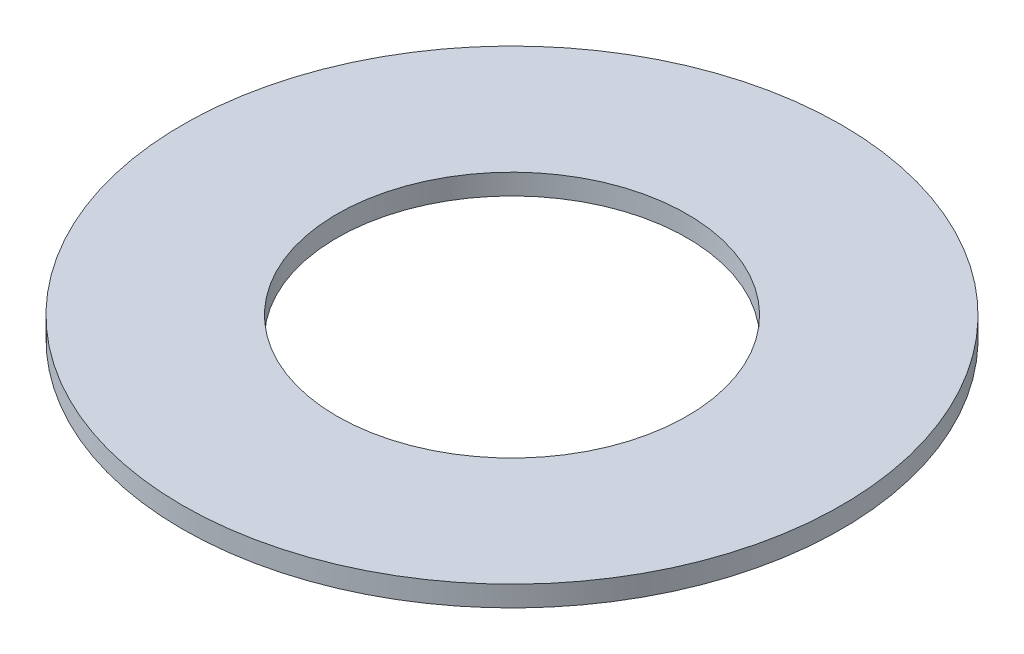
ISO-10303-21;
HEADER;
FILE_DESCRIPTION(('STEP AP214'),'2;1');
FILE_NAME('part.step','',(''),(''),'','','');
FILE_SCHEMA(('AUTOMOTIVE_DESIGN { 1 0 10303 214 1 1 1 1 }'));
ENDSEC;
DATA;
#1=APPLICATION_CONTEXT('core data for automotive mechanical design processes');
#2=APPLICATION_PROTOCOL_DEFINITION('international standard','automotive_design',2000,#1);
#3=PRODUCT_CONTEXT('',#1,'mechanical');
#4=PRODUCT('Part','Part','',(#3));
#5=PRODUCT_RELATED_PRODUCT_CATEGORY('part','',(#4));
#6=PRODUCT_DEFINITION_FORMATION('','',#4);
#7=PRODUCT_DEFINITION_CONTEXT('part definition',#1,'design');
#8=PRODUCT_DEFINITION('design','',#6,#7);
#9=PRODUCT_DEFINITION_SHAPE('','',#8);
#10=(LENGTH_UNIT() NAMED_UNIT(*) SI_UNIT(.MILLI.,.METRE.));
#11=(NAMED_UNIT(*) PLANE_ANGLE_UNIT() SI_UNIT($,.RADIAN.));
#12=(NAMED_UNIT(*) SI_UNIT($,.STERADIAN.) SOLID_ANGLE_UNIT());
#13=UNCERTAINTY_MEASURE_WITH_UNIT(LENGTH_MEASURE(1.E-05),#10,'distance_accuracy_value','');
#14=(GEOMETRIC_REPRESENTATION_CONTEXT(3) GLOBAL_UNCERTAINTY_ASSIGNED_CONTEXT((#13)) GLOBAL_UNIT_ASSIGNED_CONTEXT((#10,
#11,#12)) REPRESENTATION_CONTEXT('',''));
#15=CARTESIAN_POINT('',(0.,0.,0.));
#16=DIRECTION('',(0.,0.,1.));
#17=DIRECTION('',(1.,0.,0.));
#18=AXIS2_PLACEMENT_3D('',#15,#16,#17);
#19=CARTESIAN_POINT('',(0.,5.,0.));
#20=DIRECTION('',(0.,-1.,0.));
#21=DIRECTION('',(0.,0.,-1.));
#22=AXIS2_PLACEMENT_3D('',#19,#20,#21);
#23=CYLINDRICAL_SURFACE('',#22,80.);
#24=CARTESIAN_POINT('',(0.,5.,0.));
#25=DIRECTION('',(0.,1.,0.));
#26=DIRECTION('',(0.,0.,1.));
#27=AXIS2_PLACEMENT_3D('',#24,#25,#26);
#28=CIRCLE('',#27,80.);
#29=CARTESIAN_POINT('',(0.,5.,80.));
#30=VERTEX_POINT('',#29);
#31=EDGE_CURVE('E10',#30,#30,#28,.T.);
#32=ORIENTED_EDGE('',*,*,#31,.F.);
#33=EDGE_LOOP('',(#32));
#34=FACE_BOUND('',#33,.T.);
#35=CARTESIAN_POINT('',(0.,0.,0.));
#36=DIRECTION('',(0.,1.,0.));
#37=DIRECTION('',(0.,0.,1.));
#38=AXIS2_PLACEMENT_3D('',#35,#36,#37);
#39=CIRCLE('',#38,80.);
#40=CARTESIAN_POINT('',(0.,0.,80.));
#41=VERTEX_POINT('',#40);
#42=EDGE_CURVE('E37',#41,#41,#39,.T.);
#43=ORIENTED_EDGE('',*,*,#42,.T.);
#44=EDGE_LOOP('',(#43));
#45=FACE_BOUND('',#44,.T.);
#46=ADVANCED_FACE('F40',(#34,#45),#23,.T.);
#47=CARTESIAN_POINT('',(0.,5.,0.));
#48=DIRECTION('',(0.,1.,0.));
#49=DIRECTION('',(0.,0.,1.));
#50=AXIS2_PLACEMENT_3D('',#47,#48,#49);
#51=PLANE('',#50);
#52=CARTESIAN_POINT('',(0.,5.,0.));
#53=DIRECTION('',(0.,1.,0.));
#54=DIRECTION('',(0.,0.,1.));
#55=AXIS2_PLACEMENT_3D('',#52,#53,#54);
#56=CIRCLE('',#55,42.5);
#57=CARTESIAN_POINT('',(0.,5.,42.5));
#58=VERTEX_POINT('',#57);
#59=EDGE_CURVE('E50',#58,#58,#56,.T.);
#60=ORIENTED_EDGE('',*,*,#59,.F.);
#61=EDGE_LOOP('',(#60));
#62=FACE_BOUND('',#61,.T.);
#63=ORIENTED_EDGE('',*,*,#31,.T.);
#64=EDGE_LOOP('',(#63));
#65=FACE_BOUND('',#64,.T.);
#66=ADVANCED_FACE('F59',(#62,#65),#51,.T.);
#67=CARTESIAN_POINT('',(0.,0.,0.));
#68=DIRECTION('',(0.,1.,0.));
#69=DIRECTION('',(0.,0.,1.));
#70=AXIS2_PLACEMENT_3D('',#67,#68,#69);
#71=PLANE('',#70);
#72=CARTESIAN_POINT('',(0.,0.,0.));
#73=DIRECTION('',(0.,1.,0.));
#74=DIRECTION('',(0.,0.,1.));
#75=AXIS2_PLACEMENT_3D('',#72,#73,#74);
#76=CIRCLE('',#75,42.5);
#77=CARTESIAN_POINT('',(0.,0.,42.5));
#78=VERTEX_POINT('',#77);
#79=EDGE_CURVE('E47',#78,#78,#76,.T.);
#80=ORIENTED_EDGE('',*,*,#79,.T.);
#81=EDGE_LOOP('',(#80));
#82=FACE_BOUND('',#81,.T.);
#83=ORIENTED_EDGE('',*,*,#42,.F.);
#84=EDGE_LOOP('',(#83));
#85=FACE_BOUND('',#84,.T.);
#86=ADVANCED_FACE('F58',(#82,#85),#71,.F.);
#87=CARTESIAN_POINT('',(0.,5.,0.));
#88=DIRECTION('',(0.,-1.,0.));
#89=DIRECTION('',(0.,0.,-1.));
#90=AXIS2_PLACEMENT_3D('',#87,#88,#89);
#91=CYLINDRICAL_SURFACE('',#90,42.5);
#92=ORIENTED_EDGE('',*,*,#59,.T.);
#93=EDGE_LOOP('',(#92));
#94=FACE_BOUND('',#93,.T.);
#95=ORIENTED_EDGE('',*,*,#79,.F.);
#96=EDGE_LOOP('',(#95));
#97=FACE_BOUND('',#96,.T.);
#98=ADVANCED_FACE('F54',(#94,#97),#91,.F.);
#99=CLOSED_SHELL('',(#46,#66,#86,#98));
#100=MANIFOLD_SOLID_BREP('B2',#99);
#101=ADVANCED_BREP_SHAPE_REPRESENTATION('',(#18,#100),#14);
#102=SHAPE_DEFINITION_REPRESENTATION(#9,#101);
ENDSEC;
END-ISO-10303-21;
